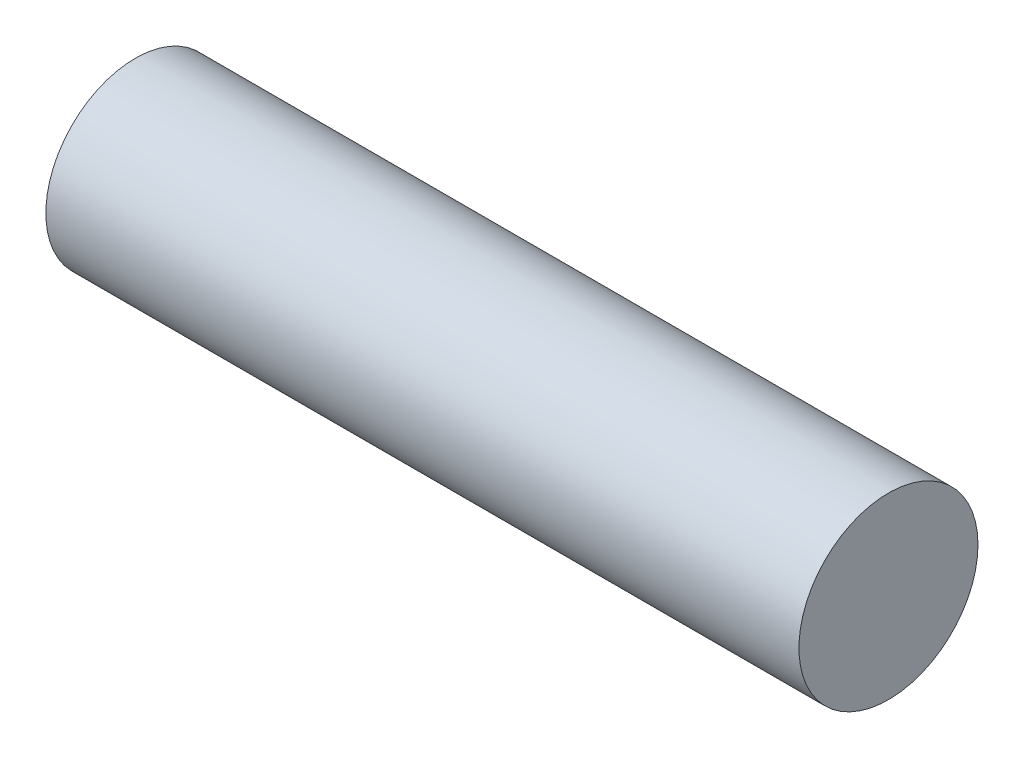
ISO-10303-21;
HEADER;
FILE_DESCRIPTION(('STEP AP214'),'2;1');
FILE_NAME('part.step','',(''),(''),'','','');
FILE_SCHEMA(('AUTOMOTIVE_DESIGN { 1 0 10303 214 1 1 1 1 }'));
ENDSEC;
DATA;
#1=APPLICATION_CONTEXT('core data for automotive mechanical design processes');
#2=APPLICATION_PROTOCOL_DEFINITION('international standard','automotive_design',2000,#1);
#3=PRODUCT_CONTEXT('',#1,'mechanical');
#4=PRODUCT('Part','Part','',(#3));
#5=PRODUCT_RELATED_PRODUCT_CATEGORY('part','',(#4));
#6=PRODUCT_DEFINITION_FORMATION('','',#4);
#7=PRODUCT_DEFINITION_CONTEXT('part definition',#1,'design');
#8=PRODUCT_DEFINITION('design','',#6,#7);
#9=PRODUCT_DEFINITION_SHAPE('','',#8);
#10=(LENGTH_UNIT() NAMED_UNIT(*) SI_UNIT(.MILLI.,.METRE.));
#11=(NAMED_UNIT(*) PLANE_ANGLE_UNIT() SI_UNIT($,.RADIAN.));
#12=(NAMED_UNIT(*) SI_UNIT($,.STERADIAN.) SOLID_ANGLE_UNIT());
#13=UNCERTAINTY_MEASURE_WITH_UNIT(LENGTH_MEASURE(1.E-05),#10,'distance_accuracy_value','');
#14=(GEOMETRIC_REPRESENTATION_CONTEXT(3) GLOBAL_UNCERTAINTY_ASSIGNED_CONTEXT((#13)) GLOBAL_UNIT_ASSIGNED_CONTEXT((#10,
#11,#12)) REPRESENTATION_CONTEXT('',''));
#15=CARTESIAN_POINT('',(0.,0.,0.));
#16=DIRECTION('',(0.,0.,1.));
#17=DIRECTION('',(1.,0.,0.));
#18=AXIS2_PLACEMENT_3D('',#15,#16,#17);
#19=CARTESIAN_POINT('',(0.,0.,0.));
#20=DIRECTION('',(1.,0.,0.));
#21=DIRECTION('',(0.,0.,-1.));
#22=AXIS2_PLACEMENT_3D('',#19,#20,#21);
#23=PLANE('',#22);
#24=CARTESIAN_POINT('',(0.,0.,0.));
#25=DIRECTION('',(1.,0.,0.));
#26=DIRECTION('',(0.,0.,-1.));
#27=AXIS2_PLACEMENT_3D('',#24,#25,#26);
#28=CIRCLE('',#27,10.75);
#29=CARTESIAN_POINT('',(0.,0.,-10.75));
#30=VERTEX_POINT('',#29);
#31=EDGE_CURVE('E10',#30,#30,#28,.T.);
#32=ORIENTED_EDGE('',*,*,#31,.F.);
#33=EDGE_LOOP('',(#32));
#34=FACE_BOUND('',#33,.T.);
#35=CARTESIAN_POINT('',(0.,0.,0.));
#36=DIRECTION('',(1.,0.,0.));
#37=DIRECTION('',(0.,0.,-1.));
#38=AXIS2_PLACEMENT_3D('',#35,#36,#37);
#39=CIRCLE('',#38,10.);
#40=CARTESIAN_POINT('',(0.,0.,-10.));
#41=VERTEX_POINT('',#40);
#42=EDGE_CURVE('E38',#41,#41,#39,.T.);
#43=ORIENTED_EDGE('',*,*,#42,.T.);
#44=EDGE_LOOP('',(#43));
#45=FACE_BOUND('',#44,.T.);
#46=ADVANCED_FACE('F31',(#34,#45),#23,.F.);
#47=CARTESIAN_POINT('',(89.43,0.,0.));
#48=DIRECTION('',(-1.,0.,0.));
#49=DIRECTION('',(0.,0.,1.));
#50=AXIS2_PLACEMENT_3D('',#47,#48,#49);
#51=CYLINDRICAL_SURFACE('',#50,10.75);
#52=ORIENTED_EDGE('',*,*,#31,.T.);
#53=EDGE_LOOP('',(#52));
#54=FACE_BOUND('',#53,.T.);
#55=CARTESIAN_POINT('',(90.43,0.,0.));
#56=DIRECTION('',(1.,0.,0.));
#57=DIRECTION('',(0.,0.,-1.));
#58=AXIS2_PLACEMENT_3D('',#55,#56,#57);
#59=CIRCLE('',#58,10.75);
#60=CARTESIAN_POINT('',(90.43,0.,-10.75));
#61=VERTEX_POINT('',#60);
#62=EDGE_CURVE('E46',#61,#61,#59,.T.);
#63=ORIENTED_EDGE('',*,*,#62,.F.);
#64=EDGE_LOOP('',(#63));
#65=FACE_BOUND('',#64,.T.);
#66=ADVANCED_FACE('F33',(#54,#65),#51,.T.);
#67=CARTESIAN_POINT('',(89.43,0.,0.));
#68=DIRECTION('',(-1.,0.,0.));
#69=DIRECTION('',(0.,0.,1.));
#70=AXIS2_PLACEMENT_3D('',#67,#68,#69);
#71=CYLINDRICAL_SURFACE('',#70,10.);
#72=CARTESIAN_POINT('',(89.43,0.,0.));
#73=DIRECTION('',(1.,0.,0.));
#74=DIRECTION('',(0.,0.,-1.));
#75=AXIS2_PLACEMENT_3D('',#72,#73,#74);
#76=CIRCLE('',#75,10.);
#77=CARTESIAN_POINT('',(89.43,0.,-10.));
#78=VERTEX_POINT('',#77);
#79=EDGE_CURVE('E42',#78,#78,#76,.T.);
#80=ORIENTED_EDGE('',*,*,#79,.T.);
#81=EDGE_LOOP('',(#80));
#82=FACE_BOUND('',#81,.T.);
#83=ORIENTED_EDGE('',*,*,#42,.F.);
#84=EDGE_LOOP('',(#83));
#85=FACE_BOUND('',#84,.T.);
#86=ADVANCED_FACE('F55',(#82,#85),#71,.F.);
#87=CARTESIAN_POINT('',(89.43,0.,0.));
#88=DIRECTION('',(1.,0.,0.));
#89=DIRECTION('',(0.,0.,-1.));
#90=AXIS2_PLACEMENT_3D('',#87,#88,#89);
#91=PLANE('',#90);
#92=ORIENTED_EDGE('',*,*,#79,.F.);
#93=EDGE_LOOP('',(#92));
#94=FACE_BOUND('',#93,.T.);
#95=ADVANCED_FACE('F60',(#94),#91,.F.);
#96=CARTESIAN_POINT('',(90.43,0.,0.));
#97=DIRECTION('',(1.,0.,0.));
#98=DIRECTION('',(0.,0.,-1.));
#99=AXIS2_PLACEMENT_3D('',#96,#97,#98);
#100=PLANE('',#99);
#101=ORIENTED_EDGE('',*,*,#62,.T.);
#102=EDGE_LOOP('',(#101));
#103=FACE_BOUND('',#102,.T.);
#104=ADVANCED_FACE('F52',(#103),#100,.T.);
#105=CLOSED_SHELL('',(#46,#66,#86,#95,#104));
#106=MANIFOLD_SOLID_BREP('B2',#105);
#107=ADVANCED_BREP_SHAPE_REPRESENTATION('',(#18,#106),#14);
#108=SHAPE_DEFINITION_REPRESENTATION(#9,#107);
ENDSEC;
END-ISO-10303-21;
